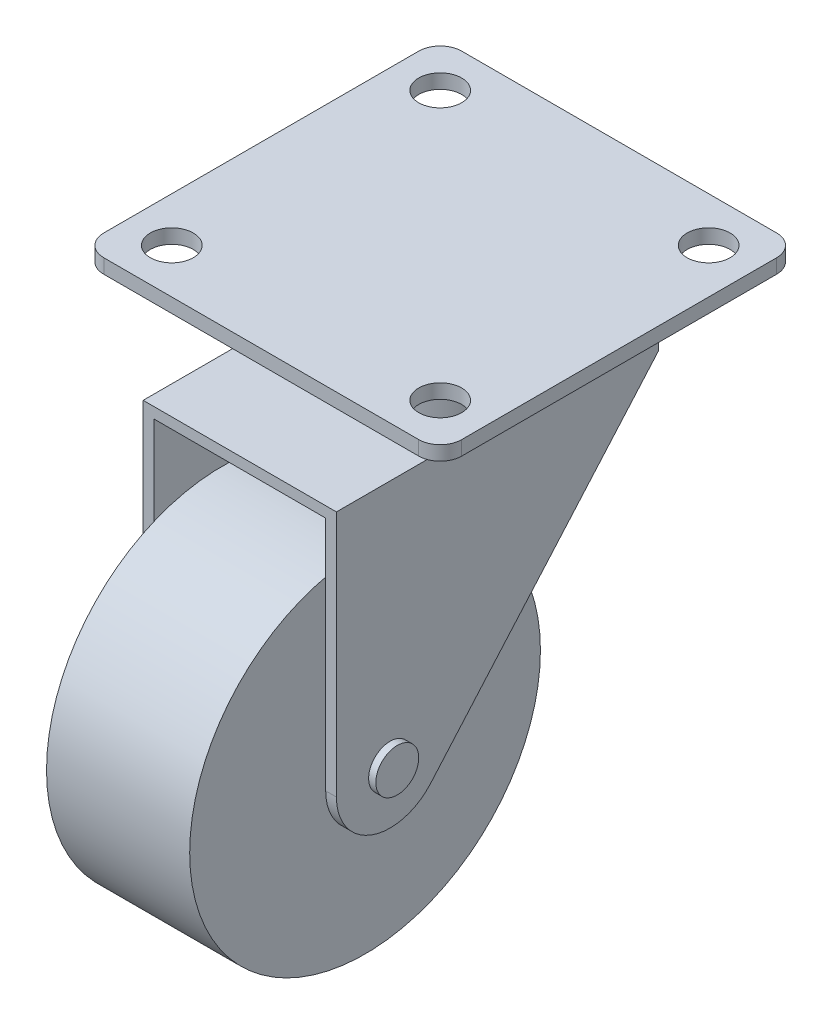
ISO-10303-21;
HEADER;
FILE_DESCRIPTION(('STEP AP214'),'2;1');
FILE_NAME('part.step','',(''),(''),'','','');
FILE_SCHEMA(('AUTOMOTIVE_DESIGN { 1 0 10303 214 1 1 1 1 }'));
ENDSEC;
DATA;
#1=APPLICATION_CONTEXT('core data for automotive mechanical design processes');
#2=APPLICATION_PROTOCOL_DEFINITION('international standard','automotive_design',2000,#1);
#3=PRODUCT_CONTEXT('',#1,'mechanical');
#4=PRODUCT('Part','Part','',(#3));
#5=PRODUCT_RELATED_PRODUCT_CATEGORY('part','',(#4));
#6=PRODUCT_DEFINITION_FORMATION('','',#4);
#7=PRODUCT_DEFINITION_CONTEXT('part definition',#1,'design');
#8=PRODUCT_DEFINITION('design','',#6,#7);
#9=PRODUCT_DEFINITION_SHAPE('','',#8);
#10=(LENGTH_UNIT() NAMED_UNIT(*) SI_UNIT(.MILLI.,.METRE.));
#11=(NAMED_UNIT(*) PLANE_ANGLE_UNIT() SI_UNIT($,.RADIAN.));
#12=(NAMED_UNIT(*) SI_UNIT($,.STERADIAN.) SOLID_ANGLE_UNIT());
#13=UNCERTAINTY_MEASURE_WITH_UNIT(LENGTH_MEASURE(1.E-05),#10,'distance_accuracy_value','');
#14=(GEOMETRIC_REPRESENTATION_CONTEXT(3) GLOBAL_UNCERTAINTY_ASSIGNED_CONTEXT((#13)) GLOBAL_UNIT_ASSIGNED_CONTEXT((#10,
#11,#12)) REPRESENTATION_CONTEXT('',''));
#15=CARTESIAN_POINT('',(0.,0.,0.));
#16=DIRECTION('',(0.,0.,1.));
#17=DIRECTION('',(1.,0.,0.));
#18=AXIS2_PLACEMENT_3D('',#15,#16,#17);
#19=CARTESIAN_POINT('',(10.,-46.,20.5));
#20=DIRECTION('',(-1.,0.,0.));
#21=DIRECTION('',(0.,0.,1.));
#22=AXIS2_PLACEMENT_3D('',#19,#20,#21);
#23=CYLINDRICAL_SURFACE('',#22,24.5);
#24=CARTESIAN_POINT('',(10.,-46.,20.5));
#25=DIRECTION('',(1.,0.,0.));
#26=DIRECTION('',(0.,0.,-1.));
#27=AXIS2_PLACEMENT_3D('',#24,#25,#26);
#28=CIRCLE('',#27,24.5);
#29=CARTESIAN_POINT('',(10.,-46.,-4.00000000000001));
#30=VERTEX_POINT('',#29);
#31=EDGE_CURVE('E12',#30,#30,#28,.T.);
#32=ORIENTED_EDGE('',*,*,#31,.F.);
#33=EDGE_LOOP('',(#32));
#34=FACE_BOUND('',#33,.T.);
#35=CARTESIAN_POINT('',(-10.,-46.,20.5));
#36=DIRECTION('',(1.,0.,0.));
#37=DIRECTION('',(0.,0.,-1.));
#38=AXIS2_PLACEMENT_3D('',#35,#36,#37);
#39=CIRCLE('',#38,24.5);
#40=CARTESIAN_POINT('',(-10.,-46.,-4.00000000000001));
#41=VERTEX_POINT('',#40);
#42=EDGE_CURVE('E53',#41,#41,#39,.T.);
#43=ORIENTED_EDGE('',*,*,#42,.T.);
#44=EDGE_LOOP('',(#43));
#45=FACE_BOUND('',#44,.T.);
#46=ADVANCED_FACE('F50',(#34,#45),#23,.T.);
#47=CARTESIAN_POINT('',(10.,-46.,20.5));
#48=DIRECTION('',(1.,0.,0.));
#49=DIRECTION('',(0.,0.,-1.));
#50=AXIS2_PLACEMENT_3D('',#47,#48,#49);
#51=PLANE('',#50);
#52=ORIENTED_EDGE('',*,*,#31,.T.);
#53=EDGE_LOOP('',(#52));
#54=FACE_BOUND('',#53,.T.);
#55=ADVANCED_FACE('F67',(#54),#51,.T.);
#56=CARTESIAN_POINT('',(-10.,-46.,20.5));
#57=DIRECTION('',(1.,0.,0.));
#58=DIRECTION('',(0.,0.,-1.));
#59=AXIS2_PLACEMENT_3D('',#56,#57,#58);
#60=PLANE('',#59);
#61=ORIENTED_EDGE('',*,*,#42,.F.);
#62=EDGE_LOOP('',(#61));
#63=FACE_BOUND('',#62,.T.);
#64=ADVANCED_FACE('F65',(#63),#60,.F.);
#65=CLOSED_SHELL('',(#46,#55,#64));
#66=MANIFOLD_SOLID_BREP('B2',#65);
#67=CARTESIAN_POINT('',(-22.,-2.,-22.));
#68=DIRECTION('',(0.,1.,0.));
#69=DIRECTION('',(0.,0.,1.));
#70=AXIS2_PLACEMENT_3D('',#67,#68,#69);
#71=CYLINDRICAL_SURFACE('',#70,3.);
#72=CARTESIAN_POINT('',(-22.,0.,-22.));
#73=DIRECTION('',(0.,1.,0.));
#74=DIRECTION('',(0.,0.,-1.));
#75=AXIS2_PLACEMENT_3D('',#72,#73,#74);
#76=CIRCLE('',#75,3.);
#77=CARTESIAN_POINT('',(-22.,0.,-25.));
#78=VERTEX_POINT('',#77);
#79=CARTESIAN_POINT('',(-25.,0.,-22.));
#80=VERTEX_POINT('',#79);
#81=EDGE_CURVE('E202',#78,#80,#76,.T.);
#82=ORIENTED_EDGE('',*,*,#81,.F.);
#83=DIRECTION('',(0.,1.,0.));
#84=VECTOR('',#83,1.);
#85=CARTESIAN_POINT('',(-22.,-2.,-25.));
#86=LINE('',#85,#84);
#87=CARTESIAN_POINT('',(-22.,-2.,-25.));
#88=VERTEX_POINT('',#87);
#89=EDGE_CURVE('E48',#88,#78,#86,.T.);
#90=ORIENTED_EDGE('',*,*,#89,.F.);
#91=CARTESIAN_POINT('',(-22.,-2.,-22.));
#92=DIRECTION('',(0.,1.,0.));
#93=DIRECTION('',(0.,0.,-1.));
#94=AXIS2_PLACEMENT_3D('',#91,#92,#93);
#95=CIRCLE('',#94,3.);
#96=CARTESIAN_POINT('',(-25.,-2.,-22.));
#97=VERTEX_POINT('',#96);
#98=EDGE_CURVE('E223',#88,#97,#95,.T.);
#99=ORIENTED_EDGE('',*,*,#98,.T.);
#100=DIRECTION('',(0.,1.,0.));
#101=VECTOR('',#100,1.);
#102=CARTESIAN_POINT('',(-25.,-2.,-22.));
#103=LINE('',#102,#101);
#104=EDGE_CURVE('E96',#97,#80,#103,.T.);
#105=ORIENTED_EDGE('',*,*,#104,.T.);
#106=EDGE_LOOP('',(#82,#90,#99,#105));
#107=FACE_BOUND('',#106,.T.);
#108=ADVANCED_FACE('F93',(#107),#71,.T.);
#109=CARTESIAN_POINT('',(-22.,-2.,-25.));
#110=DIRECTION('',(0.,0.,-1.));
#111=DIRECTION('',(-1.,0.,0.));
#112=AXIS2_PLACEMENT_3D('',#109,#110,#111);
#113=PLANE('',#112);
#114=DIRECTION('',(-1.,0.,0.));
#115=VECTOR('',#114,1.);
#116=CARTESIAN_POINT('',(-22.,0.,-25.));
#117=LINE('',#116,#115);
#118=CARTESIAN_POINT('',(22.,0.,-25.));
#119=VERTEX_POINT('',#118);
#120=EDGE_CURVE('E221',#119,#78,#117,.T.);
#121=ORIENTED_EDGE('',*,*,#120,.F.);
#122=DIRECTION('',(0.,1.,0.));
#123=VECTOR('',#122,1.);
#124=CARTESIAN_POINT('',(22.,-2.,-25.));
#125=LINE('',#124,#123);
#126=CARTESIAN_POINT('',(22.,-2.,-25.));
#127=VERTEX_POINT('',#126);
#128=EDGE_CURVE('E101',#127,#119,#125,.T.);
#129=ORIENTED_EDGE('',*,*,#128,.F.);
#130=DIRECTION('',(-1.,0.,0.));
#131=VECTOR('',#130,1.);
#132=CARTESIAN_POINT('',(-22.,-2.,-25.));
#133=LINE('',#132,#131);
#134=EDGE_CURVE('E192',#127,#88,#133,.T.);
#135=ORIENTED_EDGE('',*,*,#134,.T.);
#136=ORIENTED_EDGE('',*,*,#89,.T.);
#137=EDGE_LOOP('',(#121,#129,#135,#136));
#138=FACE_BOUND('',#137,.T.);
#139=ADVANCED_FACE('F235',(#138),#113,.T.);
#140=CARTESIAN_POINT('',(22.,-2.,-22.));
#141=DIRECTION('',(0.,1.,0.));
#142=DIRECTION('',(0.,0.,1.));
#143=AXIS2_PLACEMENT_3D('',#140,#141,#142);
#144=CYLINDRICAL_SURFACE('',#143,3.);
#145=CARTESIAN_POINT('',(22.,0.,-22.));
#146=DIRECTION('',(0.,1.,0.));
#147=DIRECTION('',(0.,0.,-1.));
#148=AXIS2_PLACEMENT_3D('',#145,#146,#147);
#149=CIRCLE('',#148,3.);
#150=CARTESIAN_POINT('',(25.,0.,-22.));
#151=VERTEX_POINT('',#150);
#152=EDGE_CURVE('E179',#151,#119,#149,.T.);
#153=ORIENTED_EDGE('',*,*,#152,.F.);
#154=DIRECTION('',(0.,1.,0.));
#155=VECTOR('',#154,1.);
#156=CARTESIAN_POINT('',(25.,-2.,-22.));
#157=LINE('',#156,#155);
#158=CARTESIAN_POINT('',(25.,-2.,-22.));
#159=VERTEX_POINT('',#158);
#160=EDGE_CURVE('E173',#159,#151,#157,.T.);
#161=ORIENTED_EDGE('',*,*,#160,.F.);
#162=CARTESIAN_POINT('',(22.,-2.,-22.));
#163=DIRECTION('',(0.,1.,0.));
#164=DIRECTION('',(0.,0.,-1.));
#165=AXIS2_PLACEMENT_3D('',#162,#163,#164);
#166=CIRCLE('',#165,3.);
#167=EDGE_CURVE('E176',#159,#127,#166,.T.);
#168=ORIENTED_EDGE('',*,*,#167,.T.);
#169=ORIENTED_EDGE('',*,*,#128,.T.);
#170=EDGE_LOOP('',(#153,#161,#168,#169));
#171=FACE_BOUND('',#170,.T.);
#172=ADVANCED_FACE('F175',(#171),#144,.T.);
#173=CARTESIAN_POINT('',(25.,-2.,22.));
#174=DIRECTION('',(1.,0.,0.));
#175=DIRECTION('',(0.,0.,-1.));
#176=AXIS2_PLACEMENT_3D('',#173,#174,#175);
#177=PLANE('',#176);
#178=DIRECTION('',(0.,0.,-1.));
#179=VECTOR('',#178,1.);
#180=CARTESIAN_POINT('',(25.,0.,22.));
#181=LINE('',#180,#179);
#182=CARTESIAN_POINT('',(25.,0.,22.));
#183=VERTEX_POINT('',#182);
#184=EDGE_CURVE('E218',#183,#151,#181,.T.);
#185=ORIENTED_EDGE('',*,*,#184,.F.);
#186=DIRECTION('',(0.,1.,0.));
#187=VECTOR('',#186,1.);
#188=CARTESIAN_POINT('',(25.,-2.,22.));
#189=LINE('',#188,#187);
#190=CARTESIAN_POINT('',(25.,-2.,22.));
#191=VERTEX_POINT('',#190);
#192=EDGE_CURVE('E184',#191,#183,#189,.T.);
#193=ORIENTED_EDGE('',*,*,#192,.F.);
#194=DIRECTION('',(0.,0.,-1.));
#195=VECTOR('',#194,1.);
#196=CARTESIAN_POINT('',(25.,-2.,22.));
#197=LINE('',#196,#195);
#198=EDGE_CURVE('E190',#191,#159,#197,.T.);
#199=ORIENTED_EDGE('',*,*,#198,.T.);
#200=ORIENTED_EDGE('',*,*,#160,.T.);
#201=EDGE_LOOP('',(#185,#193,#199,#200));
#202=FACE_BOUND('',#201,.T.);
#203=ADVANCED_FACE('F194',(#202),#177,.T.);
#204=CARTESIAN_POINT('',(22.,-2.,22.));
#205=DIRECTION('',(0.,1.,0.));
#206=DIRECTION('',(0.,0.,1.));
#207=AXIS2_PLACEMENT_3D('',#204,#205,#206);
#208=CYLINDRICAL_SURFACE('',#207,3.);
#209=CARTESIAN_POINT('',(22.,0.,22.));
#210=DIRECTION('',(0.,1.,0.));
#211=DIRECTION('',(0.,0.,1.));
#212=AXIS2_PLACEMENT_3D('',#209,#210,#211);
#213=CIRCLE('',#212,3.);
#214=CARTESIAN_POINT('',(22.,0.,25.));
#215=VERTEX_POINT('',#214);
#216=EDGE_CURVE('E215',#215,#183,#213,.T.);
#217=ORIENTED_EDGE('',*,*,#216,.F.);
#218=DIRECTION('',(0.,1.,0.));
#219=VECTOR('',#218,1.);
#220=CARTESIAN_POINT('',(22.,-2.,25.));
#221=LINE('',#220,#219);
#222=CARTESIAN_POINT('',(22.,-2.,25.));
#223=VERTEX_POINT('',#222);
#224=EDGE_CURVE('E227',#223,#215,#221,.T.);
#225=ORIENTED_EDGE('',*,*,#224,.F.);
#226=CARTESIAN_POINT('',(22.,-2.,22.));
#227=DIRECTION('',(0.,1.,0.));
#228=DIRECTION('',(0.,0.,1.));
#229=AXIS2_PLACEMENT_3D('',#226,#227,#228);
#230=CIRCLE('',#229,3.);
#231=EDGE_CURVE('E195',#223,#191,#230,.T.);
#232=ORIENTED_EDGE('',*,*,#231,.T.);
#233=ORIENTED_EDGE('',*,*,#192,.T.);
#234=EDGE_LOOP('',(#217,#225,#232,#233));
#235=FACE_BOUND('',#234,.T.);
#236=ADVANCED_FACE('F248',(#235),#208,.T.);
#237=CARTESIAN_POINT('',(-22.,-2.,25.));
#238=DIRECTION('',(0.,0.,1.));
#239=DIRECTION('',(1.,0.,0.));
#240=AXIS2_PLACEMENT_3D('',#237,#238,#239);
#241=PLANE('',#240);
#242=DIRECTION('',(1.,0.,0.));
#243=VECTOR('',#242,1.);
#244=CARTESIAN_POINT('',(-22.,0.,25.));
#245=LINE('',#244,#243);
#246=CARTESIAN_POINT('',(-22.,0.,25.));
#247=VERTEX_POINT('',#246);
#248=EDGE_CURVE('E212',#247,#215,#245,.T.);
#249=ORIENTED_EDGE('',*,*,#248,.F.);
#250=DIRECTION('',(0.,1.,0.));
#251=VECTOR('',#250,1.);
#252=CARTESIAN_POINT('',(-22.,-2.,25.));
#253=LINE('',#252,#251);
#254=CARTESIAN_POINT('',(-22.,-2.,25.));
#255=VERTEX_POINT('',#254);
#256=EDGE_CURVE('E229',#255,#247,#253,.T.);
#257=ORIENTED_EDGE('',*,*,#256,.F.);
#258=DIRECTION('',(1.,0.,0.));
#259=VECTOR('',#258,1.);
#260=CARTESIAN_POINT('',(-22.,-2.,25.));
#261=LINE('',#260,#259);
#262=EDGE_CURVE('E197',#255,#223,#261,.T.);
#263=ORIENTED_EDGE('',*,*,#262,.T.);
#264=ORIENTED_EDGE('',*,*,#224,.T.);
#265=EDGE_LOOP('',(#249,#257,#263,#264));
#266=FACE_BOUND('',#265,.T.);
#267=ADVANCED_FACE('F251',(#266),#241,.T.);
#268=CARTESIAN_POINT('',(-22.,-2.,22.));
#269=DIRECTION('',(0.,1.,0.));
#270=DIRECTION('',(0.,0.,1.));
#271=AXIS2_PLACEMENT_3D('',#268,#269,#270);
#272=CYLINDRICAL_SURFACE('',#271,3.);
#273=CARTESIAN_POINT('',(-22.,0.,22.));
#274=DIRECTION('',(0.,1.,0.));
#275=DIRECTION('',(0.,0.,-1.));
#276=AXIS2_PLACEMENT_3D('',#273,#274,#275);
#277=CIRCLE('',#276,3.);
#278=CARTESIAN_POINT('',(-25.,0.,22.));
#279=VERTEX_POINT('',#278);
#280=EDGE_CURVE('E209',#279,#247,#277,.T.);
#281=ORIENTED_EDGE('',*,*,#280,.F.);
#282=DIRECTION('',(0.,1.,0.));
#283=VECTOR('',#282,1.);
#284=CARTESIAN_POINT('',(-25.,-2.,22.));
#285=LINE('',#284,#283);
#286=CARTESIAN_POINT('',(-25.,-2.,22.));
#287=VERTEX_POINT('',#286);
#288=EDGE_CURVE('E230',#287,#279,#285,.T.);
#289=ORIENTED_EDGE('',*,*,#288,.F.);
#290=CARTESIAN_POINT('',(-22.,-2.,22.));
#291=DIRECTION('',(0.,1.,0.));
#292=DIRECTION('',(0.,0.,-1.));
#293=AXIS2_PLACEMENT_3D('',#290,#291,#292);
#294=CIRCLE('',#293,3.);
#295=EDGE_CURVE('E490',#287,#255,#294,.T.);
#296=ORIENTED_EDGE('',*,*,#295,.T.);
#297=ORIENTED_EDGE('',*,*,#256,.T.);
#298=EDGE_LOOP('',(#281,#289,#296,#297));
#299=FACE_BOUND('',#298,.T.);
#300=ADVANCED_FACE('F255',(#299),#272,.T.);
#301=CARTESIAN_POINT('',(-25.,-2.,22.));
#302=DIRECTION('',(-1.,0.,0.));
#303=DIRECTION('',(0.,0.,1.));
#304=AXIS2_PLACEMENT_3D('',#301,#302,#303);
#305=PLANE('',#304);
#306=DIRECTION('',(0.,0.,1.));
#307=VECTOR('',#306,1.);
#308=CARTESIAN_POINT('',(-25.,0.,22.));
#309=LINE('',#308,#307);
#310=EDGE_CURVE('E205',#80,#279,#309,.T.);
#311=ORIENTED_EDGE('',*,*,#310,.F.);
#312=ORIENTED_EDGE('',*,*,#104,.F.);
#313=DIRECTION('',(0.,0.,1.));
#314=VECTOR('',#313,1.);
#315=CARTESIAN_POINT('',(-25.,-2.,22.));
#316=LINE('',#315,#314);
#317=EDGE_CURVE('E488',#97,#287,#316,.T.);
#318=ORIENTED_EDGE('',*,*,#317,.T.);
#319=ORIENTED_EDGE('',*,*,#288,.T.);
#320=EDGE_LOOP('',(#311,#312,#318,#319));
#321=FACE_BOUND('',#320,.T.);
#322=ADVANCED_FACE('F232',(#321),#305,.T.);
#323=CARTESIAN_POINT('',(-22.,-2.,-22.));
#324=DIRECTION('',(0.,-1.,0.));
#325=DIRECTION('',(0.,0.,-1.));
#326=AXIS2_PLACEMENT_3D('',#323,#324,#325);
#327=PLANE('',#326);
#328=CARTESIAN_POINT('',(0.,-2.,0.));
#329=DIRECTION('',(0.,-1.,0.));
#330=DIRECTION('',(0.,0.,-1.));
#331=AXIS2_PLACEMENT_3D('',#328,#329,#330);
#332=CIRCLE('',#331,13.5);
#333=CARTESIAN_POINT('',(0.,-2.,-13.5));
#334=VERTEX_POINT('',#333);
#335=EDGE_CURVE('E460',#334,#334,#332,.T.);
#336=ORIENTED_EDGE('',*,*,#335,.F.);
#337=EDGE_LOOP('',(#336));
#338=FACE_BOUND('',#337,.T.);
#339=CARTESIAN_POINT('',(-18.75,-2.,-18.75));
#340=DIRECTION('',(0.,1.,0.));
#341=DIRECTION('',(0.,0.,1.));
#342=AXIS2_PLACEMENT_3D('',#339,#340,#341);
#343=CIRCLE('',#342,3.);
#344=CARTESIAN_POINT('',(-18.75,-2.,-15.75));
#345=VERTEX_POINT('',#344);
#346=EDGE_CURVE('E465',#345,#345,#343,.T.);
#347=ORIENTED_EDGE('',*,*,#346,.T.);
#348=EDGE_LOOP('',(#347));
#349=FACE_BOUND('',#348,.T.);
#350=CARTESIAN_POINT('',(-18.75,-2.,18.75));
#351=DIRECTION('',(0.,1.,0.));
#352=DIRECTION('',(0.,0.,1.));
#353=AXIS2_PLACEMENT_3D('',#350,#351,#352);
#354=CIRCLE('',#353,3.);
#355=CARTESIAN_POINT('',(-18.75,-2.,21.75));
#356=VERTEX_POINT('',#355);
#357=EDGE_CURVE('E471',#356,#356,#354,.T.);
#358=ORIENTED_EDGE('',*,*,#357,.T.);
#359=EDGE_LOOP('',(#358));
#360=FACE_BOUND('',#359,.T.);
#361=CARTESIAN_POINT('',(18.75,-2.,-18.75));
#362=DIRECTION('',(0.,1.,0.));
#363=DIRECTION('',(0.,0.,1.));
#364=AXIS2_PLACEMENT_3D('',#361,#362,#363);
#365=CIRCLE('',#364,3.);
#366=CARTESIAN_POINT('',(18.75,-2.,-15.75));
#367=VERTEX_POINT('',#366);
#368=EDGE_CURVE('E477',#367,#367,#365,.T.);
#369=ORIENTED_EDGE('',*,*,#368,.T.);
#370=EDGE_LOOP('',(#369));
#371=FACE_BOUND('',#370,.T.);
#372=CARTESIAN_POINT('',(18.75,-2.,18.75));
#373=DIRECTION('',(0.,1.,0.));
#374=DIRECTION('',(0.,0.,1.));
#375=AXIS2_PLACEMENT_3D('',#372,#373,#374);
#376=CIRCLE('',#375,3.);
#377=CARTESIAN_POINT('',(18.75,-2.,21.75));
#378=VERTEX_POINT('',#377);
#379=EDGE_CURVE('E206',#378,#378,#376,.T.);
#380=ORIENTED_EDGE('',*,*,#379,.T.);
#381=EDGE_LOOP('',(#380));
#382=FACE_BOUND('',#381,.T.);
#383=ORIENTED_EDGE('',*,*,#98,.F.);
#384=ORIENTED_EDGE('',*,*,#134,.F.);
#385=ORIENTED_EDGE('',*,*,#167,.F.);
#386=ORIENTED_EDGE('',*,*,#198,.F.);
#387=ORIENTED_EDGE('',*,*,#231,.F.);
#388=ORIENTED_EDGE('',*,*,#262,.F.);
#389=ORIENTED_EDGE('',*,*,#295,.F.);
#390=ORIENTED_EDGE('',*,*,#317,.F.);
#391=EDGE_LOOP('',(#383,#384,#385,#386,#387,#388,#389,#390));
#392=FACE_BOUND('',#391,.T.);
#393=ADVANCED_FACE('F188',(#338,#349,#360,#371,#382,#392),#327,.T.);
#394=CARTESIAN_POINT('',(-22.,0.,-22.));
#395=DIRECTION('',(0.,-1.,0.));
#396=DIRECTION('',(0.,0.,-1.));
#397=AXIS2_PLACEMENT_3D('',#394,#395,#396);
#398=PLANE('',#397);
#399=CARTESIAN_POINT('',(-18.75,0.,-18.75));
#400=DIRECTION('',(0.,1.,0.));
#401=DIRECTION('',(0.,0.,1.));
#402=AXIS2_PLACEMENT_3D('',#399,#400,#401);
#403=CIRCLE('',#402,3.);
#404=CARTESIAN_POINT('',(-18.75,0.,-15.75));
#405=VERTEX_POINT('',#404);
#406=EDGE_CURVE('E464',#405,#405,#403,.T.);
#407=ORIENTED_EDGE('',*,*,#406,.F.);
#408=EDGE_LOOP('',(#407));
#409=FACE_BOUND('',#408,.T.);
#410=CARTESIAN_POINT('',(-18.75,0.,18.75));
#411=DIRECTION('',(0.,1.,0.));
#412=DIRECTION('',(0.,0.,1.));
#413=AXIS2_PLACEMENT_3D('',#410,#411,#412);
#414=CIRCLE('',#413,3.);
#415=CARTESIAN_POINT('',(-18.75,0.,21.75));
#416=VERTEX_POINT('',#415);
#417=EDGE_CURVE('E468',#416,#416,#414,.T.);
#418=ORIENTED_EDGE('',*,*,#417,.F.);
#419=EDGE_LOOP('',(#418));
#420=FACE_BOUND('',#419,.T.);
#421=CARTESIAN_POINT('',(18.75,0.,-18.75));
#422=DIRECTION('',(0.,1.,0.));
#423=DIRECTION('',(0.,0.,1.));
#424=AXIS2_PLACEMENT_3D('',#421,#422,#423);
#425=CIRCLE('',#424,3.);
#426=CARTESIAN_POINT('',(18.75,0.,-15.75));
#427=VERTEX_POINT('',#426);
#428=EDGE_CURVE('E474',#427,#427,#425,.T.);
#429=ORIENTED_EDGE('',*,*,#428,.F.);
#430=EDGE_LOOP('',(#429));
#431=FACE_BOUND('',#430,.T.);
#432=CARTESIAN_POINT('',(18.75,0.,18.75));
#433=DIRECTION('',(0.,1.,0.));
#434=DIRECTION('',(0.,0.,1.));
#435=AXIS2_PLACEMENT_3D('',#432,#433,#434);
#436=CIRCLE('',#435,3.);
#437=CARTESIAN_POINT('',(18.75,0.,21.75));
#438=VERTEX_POINT('',#437);
#439=EDGE_CURVE('E480',#438,#438,#436,.T.);
#440=ORIENTED_EDGE('',*,*,#439,.F.);
#441=EDGE_LOOP('',(#440));
#442=FACE_BOUND('',#441,.T.);
#443=ORIENTED_EDGE('',*,*,#81,.T.);
#444=ORIENTED_EDGE('',*,*,#310,.T.);
#445=ORIENTED_EDGE('',*,*,#280,.T.);
#446=ORIENTED_EDGE('',*,*,#248,.T.);
#447=ORIENTED_EDGE('',*,*,#216,.T.);
#448=ORIENTED_EDGE('',*,*,#184,.T.);
#449=ORIENTED_EDGE('',*,*,#152,.T.);
#450=ORIENTED_EDGE('',*,*,#120,.T.);
#451=EDGE_LOOP('',(#443,#444,#445,#446,#447,#448,#449,#450));
#452=FACE_BOUND('',#451,.T.);
#453=ADVANCED_FACE('F234',(#409,#420,#431,#442,#452),#398,.F.);
#454=CARTESIAN_POINT('',(18.75,-2.,18.75));
#455=DIRECTION('',(0.,1.,0.));
#456=DIRECTION('',(0.,0.,1.));
#457=AXIS2_PLACEMENT_3D('',#454,#455,#456);
#458=CYLINDRICAL_SURFACE('',#457,3.);
#459=ORIENTED_EDGE('',*,*,#379,.F.);
#460=EDGE_LOOP('',(#459));
#461=FACE_BOUND('',#460,.T.);
#462=ORIENTED_EDGE('',*,*,#439,.T.);
#463=EDGE_LOOP('',(#462));
#464=FACE_BOUND('',#463,.T.);
#465=ADVANCED_FACE('F269',(#461,#464),#458,.F.);
#466=CARTESIAN_POINT('',(18.75,-2.,-18.75));
#467=DIRECTION('',(0.,1.,0.));
#468=DIRECTION('',(0.,0.,1.));
#469=AXIS2_PLACEMENT_3D('',#466,#467,#468);
#470=CYLINDRICAL_SURFACE('',#469,3.);
#471=ORIENTED_EDGE('',*,*,#368,.F.);
#472=EDGE_LOOP('',(#471));
#473=FACE_BOUND('',#472,.T.);
#474=ORIENTED_EDGE('',*,*,#428,.T.);
#475=EDGE_LOOP('',(#474));
#476=FACE_BOUND('',#475,.T.);
#477=ADVANCED_FACE('F276',(#473,#476),#470,.F.);
#478=CARTESIAN_POINT('',(-18.75,-2.,18.75));
#479=DIRECTION('',(0.,1.,0.));
#480=DIRECTION('',(0.,0.,1.));
#481=AXIS2_PLACEMENT_3D('',#478,#479,#480);
#482=CYLINDRICAL_SURFACE('',#481,3.);
#483=ORIENTED_EDGE('',*,*,#357,.F.);
#484=EDGE_LOOP('',(#483));
#485=FACE_BOUND('',#484,.T.);
#486=ORIENTED_EDGE('',*,*,#417,.T.);
#487=EDGE_LOOP('',(#486));
#488=FACE_BOUND('',#487,.T.);
#489=ADVANCED_FACE('F280',(#485,#488),#482,.F.);
#490=CARTESIAN_POINT('',(-18.75,-2.,-18.75));
#491=DIRECTION('',(0.,1.,0.));
#492=DIRECTION('',(0.,0.,1.));
#493=AXIS2_PLACEMENT_3D('',#490,#491,#492);
#494=CYLINDRICAL_SURFACE('',#493,3.);
#495=ORIENTED_EDGE('',*,*,#346,.F.);
#496=EDGE_LOOP('',(#495));
#497=FACE_BOUND('',#496,.T.);
#498=ORIENTED_EDGE('',*,*,#406,.T.);
#499=EDGE_LOOP('',(#498));
#500=FACE_BOUND('',#499,.T.);
#501=ADVANCED_FACE('F284',(#497,#500),#494,.F.);
#502=CARTESIAN_POINT('',(0.,36.1837661840736,0.));
#503=DIRECTION('',(0.,-1.,0.));
#504=DIRECTION('',(1.,0.,0.));
#505=AXIS2_PLACEMENT_3D('',#502,#503,#504);
#506=CYLINDRICAL_SURFACE('',#505,13.5);
#507=ORIENTED_EDGE('',*,*,#335,.T.);
#508=EDGE_LOOP('',(#507));
#509=FACE_BOUND('',#508,.T.);
#510=CARTESIAN_POINT('',(0.,-11.5,0.));
#511=DIRECTION('',(0.,1.,0.));
#512=DIRECTION('',(-1.,0.,0.));
#513=AXIS2_PLACEMENT_3D('',#510,#511,#512);
#514=CIRCLE('',#513,13.5);
#515=CARTESIAN_POINT('',(-13.5,-11.5,0.));
#516=VERTEX_POINT('',#515);
#517=CARTESIAN_POINT('',(13.5,-11.5,0.));
#518=VERTEX_POINT('',#517);
#519=EDGE_CURVE('E457',#516,#518,#514,.T.);
#520=ORIENTED_EDGE('',*,*,#519,.T.);
#521=EDGE_CURVE('E461',#518,#516,#514,.T.);
#522=ORIENTED_EDGE('',*,*,#521,.T.);
#523=EDGE_LOOP('',(#520,#522));
#524=FACE_BOUND('',#523,.T.);
#525=ADVANCED_FACE('F288',(#509,#524),#506,.T.);
#526=CARTESIAN_POINT('',(13.5,-11.5,28.));
#527=DIRECTION('',(0.,-1.,0.));
#528=DIRECTION('',(1.,0.,0.));
#529=AXIS2_PLACEMENT_3D('',#526,#527,#528);
#530=PLANE('',#529);
#531=ORIENTED_EDGE('',*,*,#519,.F.);
#532=DIRECTION('',(0.,0.,-1.));
#533=VECTOR('',#532,1.);
#534=CARTESIAN_POINT('',(-13.5,-11.5,28.));
#535=LINE('',#534,#533);
#536=CARTESIAN_POINT('',(-13.5,-11.5,28.));
#537=VERTEX_POINT('',#536);
#538=EDGE_CURVE('E109',#537,#516,#535,.T.);
#539=ORIENTED_EDGE('',*,*,#538,.F.);
#540=DIRECTION('',(-1.,0.,0.));
#541=VECTOR('',#540,1.);
#542=CARTESIAN_POINT('',(13.5,-11.5,28.));
#543=LINE('',#542,#541);
#544=CARTESIAN_POINT('',(13.5,-11.5,28.));
#545=VERTEX_POINT('',#544);
#546=EDGE_CURVE('E432',#545,#537,#543,.T.);
#547=ORIENTED_EDGE('',*,*,#546,.F.);
#548=DIRECTION('',(0.,0.,-1.));
#549=VECTOR('',#548,1.);
#550=CARTESIAN_POINT('',(13.5,-11.5,28.));
#551=LINE('',#550,#549);
#552=EDGE_CURVE('E438',#545,#518,#551,.T.);
#553=ORIENTED_EDGE('',*,*,#552,.T.);
#554=EDGE_LOOP('',(#531,#539,#547,#553));
#555=FACE_BOUND('',#554,.T.);
#556=ADVANCED_FACE('F292',(#555),#530,.F.);
#557=CARTESIAN_POINT('',(-13.5,-53.5,28.));
#558=DIRECTION('',(1.,0.,0.));
#559=DIRECTION('',(0.,1.,0.));
#560=AXIS2_PLACEMENT_3D('',#557,#558,#559);
#561=PLANE('',#560);
#562=CARTESIAN_POINT('',(-13.5,-46.,20.5));
#563=DIRECTION('',(1.,0.,0.));
#564=DIRECTION('',(0.,1.,0.));
#565=AXIS2_PLACEMENT_3D('',#562,#563,#564);
#566=CIRCLE('',#565,3.);
#567=CARTESIAN_POINT('',(-13.5,-43.,20.5));
#568=VERTEX_POINT('',#567);
#569=EDGE_CURVE('E368',#568,#568,#566,.T.);
#570=ORIENTED_EDGE('',*,*,#569,.T.);
#571=EDGE_LOOP('',(#570));
#572=FACE_BOUND('',#571,.T.);
#573=DIRECTION('',(0.,0.75286600732258,-0.658173818241167));
#574=VECTOR('',#573,1.);
#575=CARTESIAN_POINT('',(-13.5,-58.9037330341487,21.818825967693));
#576=LINE('',#575,#574);
#577=CARTESIAN_POINT('',(-13.5,-50.9363036368087,14.8535049450806));
#578=VERTEX_POINT('',#577);
#579=CARTESIAN_POINT('',(-13.5,-14.5,-17.));
#580=VERTEX_POINT('',#579);
#581=EDGE_CURVE('E384',#578,#580,#576,.T.);
#582=ORIENTED_EDGE('',*,*,#581,.F.);
#583=CARTESIAN_POINT('',(-13.5,-46.,20.5));
#584=DIRECTION('',(1.,0.,0.));
#585=DIRECTION('',(0.,1.,0.));
#586=AXIS2_PLACEMENT_3D('',#583,#584,#585);
#587=CIRCLE('',#586,7.5);
#588=CARTESIAN_POINT('',(-13.5,-46.,28.));
#589=VERTEX_POINT('',#588);
#590=EDGE_CURVE('E396',#589,#578,#587,.T.);
#591=ORIENTED_EDGE('',*,*,#590,.F.);
#592=DIRECTION('',(0.,-1.,0.));
#593=VECTOR('',#592,1.);
#594=CARTESIAN_POINT('',(-13.5,-53.5,28.));
#595=LINE('',#594,#593);
#596=EDGE_CURVE('E417',#537,#589,#595,.T.);
#597=ORIENTED_EDGE('',*,*,#596,.F.);
#598=ORIENTED_EDGE('',*,*,#538,.T.);
#599=CARTESIAN_POINT('',(-13.5,-11.5,-17.));
#600=VERTEX_POINT('',#599);
#601=EDGE_CURVE('E435',#516,#600,#535,.T.);
#602=ORIENTED_EDGE('',*,*,#601,.T.);
#603=DIRECTION('',(0.,-1.,0.));
#604=VECTOR('',#603,1.);
#605=CARTESIAN_POINT('',(-13.5,-53.5,-17.));
#606=LINE('',#605,#604);
#607=EDGE_CURVE('E399',#600,#580,#606,.T.);
#608=ORIENTED_EDGE('',*,*,#607,.T.);
#609=EDGE_LOOP('',(#582,#591,#597,#598,#602,#608));
#610=FACE_BOUND('',#609,.T.);
#611=ADVANCED_FACE('F294',(#572,#610),#561,.F.);
#612=CARTESIAN_POINT('',(-12.,-53.5,28.));
#613=DIRECTION('',(-1.,0.,0.));
#614=DIRECTION('',(0.,0.,1.));
#615=AXIS2_PLACEMENT_3D('',#612,#613,#614);
#616=PLANE('',#615);
#617=CARTESIAN_POINT('',(-12.,-46.,20.5));
#618=DIRECTION('',(-1.,0.,0.));
#619=DIRECTION('',(0.,0.,1.));
#620=AXIS2_PLACEMENT_3D('',#617,#618,#619);
#621=CIRCLE('',#620,3.);
#622=CARTESIAN_POINT('',(-12.,-46.,23.5));
#623=VERTEX_POINT('',#622);
#624=EDGE_CURVE('E365',#623,#623,#621,.T.);
#625=ORIENTED_EDGE('',*,*,#624,.T.);
#626=EDGE_LOOP('',(#625));
#627=FACE_BOUND('',#626,.T.);
#628=DIRECTION('',(0.,-0.75286600732258,0.658173818241167));
#629=VECTOR('',#628,1.);
#630=CARTESIAN_POINT('',(-12.,-58.9037330341487,21.818825967693));
#631=LINE('',#630,#629);
#632=CARTESIAN_POINT('',(-12.,-14.5,-17.));
#633=VERTEX_POINT('',#632);
#634=CARTESIAN_POINT('',(-12.,-50.9363036368087,14.8535049450806));
#635=VERTEX_POINT('',#634);
#636=EDGE_CURVE('E381',#633,#635,#631,.T.);
#637=ORIENTED_EDGE('',*,*,#636,.F.);
#638=DIRECTION('',(0.,1.,0.));
#639=VECTOR('',#638,1.);
#640=CARTESIAN_POINT('',(-12.,-53.5,-17.));
#641=LINE('',#640,#639);
#642=CARTESIAN_POINT('',(-12.,-13.,-17.));
#643=VERTEX_POINT('',#642);
#644=EDGE_CURVE('E402',#633,#643,#641,.T.);
#645=ORIENTED_EDGE('',*,*,#644,.T.);
#646=DIRECTION('',(0.,0.,-1.));
#647=VECTOR('',#646,1.);
#648=CARTESIAN_POINT('',(-12.,-13.,28.));
#649=LINE('',#648,#647);
#650=CARTESIAN_POINT('',(-12.,-13.,28.));
#651=VERTEX_POINT('',#650);
#652=EDGE_CURVE('E444',#651,#643,#649,.T.);
#653=ORIENTED_EDGE('',*,*,#652,.F.);
#654=DIRECTION('',(0.,1.,0.));
#655=VECTOR('',#654,1.);
#656=CARTESIAN_POINT('',(-12.,-53.5,28.));
#657=LINE('',#656,#655);
#658=CARTESIAN_POINT('',(-12.,-46.,28.));
#659=VERTEX_POINT('',#658);
#660=EDGE_CURVE('E420',#659,#651,#657,.T.);
#661=ORIENTED_EDGE('',*,*,#660,.F.);
#662=CARTESIAN_POINT('',(-12.,-46.,20.5));
#663=DIRECTION('',(-1.,0.,0.));
#664=DIRECTION('',(0.,0.,1.));
#665=AXIS2_PLACEMENT_3D('',#662,#663,#664);
#666=CIRCLE('',#665,7.5);
#667=EDGE_CURVE('E393',#635,#659,#666,.T.);
#668=ORIENTED_EDGE('',*,*,#667,.F.);
#669=EDGE_LOOP('',(#637,#645,#653,#661,#668));
#670=FACE_BOUND('',#669,.T.);
#671=ADVANCED_FACE('F297',(#627,#670),#616,.F.);
#672=CARTESIAN_POINT('',(12.,-53.5,28.));
#673=DIRECTION('',(1.,0.,0.));
#674=DIRECTION('',(0.,0.,-1.));
#675=AXIS2_PLACEMENT_3D('',#672,#673,#674);
#676=PLANE('',#675);
#677=CARTESIAN_POINT('',(12.,-46.,20.5));
#678=DIRECTION('',(1.,0.,0.));
#679=DIRECTION('',(0.,0.,-1.));
#680=AXIS2_PLACEMENT_3D('',#677,#678,#679);
#681=CIRCLE('',#680,3.);
#682=CARTESIAN_POINT('',(12.,-46.,17.5));
#683=VERTEX_POINT('',#682);
#684=EDGE_CURVE('E362',#683,#683,#681,.T.);
#685=ORIENTED_EDGE('',*,*,#684,.T.);
#686=EDGE_LOOP('',(#685));
#687=FACE_BOUND('',#686,.T.);
#688=DIRECTION('',(0.,0.75286600732258,-0.658173818241167));
#689=VECTOR('',#688,1.);
#690=CARTESIAN_POINT('',(12.,-58.9037330341487,21.818825967693));
#691=LINE('',#690,#689);
#692=CARTESIAN_POINT('',(12.,-50.9363036368087,14.8535049450806));
#693=VERTEX_POINT('',#692);
#694=CARTESIAN_POINT('',(12.,-14.5,-17.));
#695=VERTEX_POINT('',#694);
#696=EDGE_CURVE('E378',#693,#695,#691,.T.);
#697=ORIENTED_EDGE('',*,*,#696,.F.);
#698=CARTESIAN_POINT('',(12.,-46.,20.5));
#699=DIRECTION('',(1.,0.,0.));
#700=DIRECTION('',(0.,0.,-1.));
#701=AXIS2_PLACEMENT_3D('',#698,#699,#700);
#702=CIRCLE('',#701,7.5);
#703=CARTESIAN_POINT('',(12.,-46.,28.));
#704=VERTEX_POINT('',#703);
#705=EDGE_CURVE('E390',#704,#693,#702,.T.);
#706=ORIENTED_EDGE('',*,*,#705,.F.);
#707=DIRECTION('',(0.,-1.,0.));
#708=VECTOR('',#707,1.);
#709=CARTESIAN_POINT('',(12.,-53.5,28.));
#710=LINE('',#709,#708);
#711=CARTESIAN_POINT('',(12.,-13.,28.));
#712=VERTEX_POINT('',#711);
#713=EDGE_CURVE('E426',#712,#704,#710,.T.);
#714=ORIENTED_EDGE('',*,*,#713,.F.);
#715=DIRECTION('',(0.,0.,-1.));
#716=VECTOR('',#715,1.);
#717=CARTESIAN_POINT('',(12.,-13.,28.));
#718=LINE('',#717,#716);
#719=CARTESIAN_POINT('',(12.,-13.,-17.));
#720=VERTEX_POINT('',#719);
#721=EDGE_CURVE('E441',#712,#720,#718,.T.);
#722=ORIENTED_EDGE('',*,*,#721,.T.);
#723=DIRECTION('',(0.,-1.,0.));
#724=VECTOR('',#723,1.);
#725=CARTESIAN_POINT('',(12.,-53.5,-17.));
#726=LINE('',#725,#724);
#727=EDGE_CURVE('E408',#720,#695,#726,.T.);
#728=ORIENTED_EDGE('',*,*,#727,.T.);
#729=EDGE_LOOP('',(#697,#706,#714,#722,#728));
#730=FACE_BOUND('',#729,.T.);
#731=ADVANCED_FACE('F301',(#687,#730),#676,.F.);
#732=CARTESIAN_POINT('',(13.5,-53.5,28.));
#733=DIRECTION('',(-1.,0.,0.));
#734=DIRECTION('',(0.,-1.,0.));
#735=AXIS2_PLACEMENT_3D('',#732,#733,#734);
#736=PLANE('',#735);
#737=CARTESIAN_POINT('',(13.5,-46.,20.5));
#738=DIRECTION('',(-1.,0.,0.));
#739=DIRECTION('',(0.,-1.,0.));
#740=AXIS2_PLACEMENT_3D('',#737,#738,#739);
#741=CIRCLE('',#740,3.);
#742=CARTESIAN_POINT('',(13.5,-49.,20.5));
#743=VERTEX_POINT('',#742);
#744=EDGE_CURVE('E359',#743,#743,#741,.T.);
#745=ORIENTED_EDGE('',*,*,#744,.T.);
#746=EDGE_LOOP('',(#745));
#747=FACE_BOUND('',#746,.T.);
#748=DIRECTION('',(0.,-0.75286600732258,0.658173818241167));
#749=VECTOR('',#748,1.);
#750=CARTESIAN_POINT('',(13.5,-58.9037330341487,21.818825967693));
#751=LINE('',#750,#749);
#752=CARTESIAN_POINT('',(13.5,-14.5,-17.));
#753=VERTEX_POINT('',#752);
#754=CARTESIAN_POINT('',(13.5,-50.9363036368087,14.8535049450806));
#755=VERTEX_POINT('',#754);
#756=EDGE_CURVE('E375',#753,#755,#751,.T.);
#757=ORIENTED_EDGE('',*,*,#756,.F.);
#758=DIRECTION('',(0.,1.,0.));
#759=VECTOR('',#758,1.);
#760=CARTESIAN_POINT('',(13.5,-53.5,-17.));
#761=LINE('',#760,#759);
#762=CARTESIAN_POINT('',(13.5,-11.5,-17.));
#763=VERTEX_POINT('',#762);
#764=EDGE_CURVE('E411',#753,#763,#761,.T.);
#765=ORIENTED_EDGE('',*,*,#764,.T.);
#766=EDGE_CURVE('E437',#518,#763,#551,.T.);
#767=ORIENTED_EDGE('',*,*,#766,.F.);
#768=ORIENTED_EDGE('',*,*,#552,.F.);
#769=DIRECTION('',(0.,1.,0.));
#770=VECTOR('',#769,1.);
#771=CARTESIAN_POINT('',(13.5,-53.5,28.));
#772=LINE('',#771,#770);
#773=CARTESIAN_POINT('',(13.5,-46.,28.));
#774=VERTEX_POINT('',#773);
#775=EDGE_CURVE('E429',#774,#545,#772,.T.);
#776=ORIENTED_EDGE('',*,*,#775,.F.);
#777=CARTESIAN_POINT('',(13.5,-46.,20.5));
#778=DIRECTION('',(-1.,0.,0.));
#779=DIRECTION('',(0.,-1.,0.));
#780=AXIS2_PLACEMENT_3D('',#777,#778,#779);
#781=CIRCLE('',#780,7.5);
#782=EDGE_CURVE('E387',#755,#774,#781,.T.);
#783=ORIENTED_EDGE('',*,*,#782,.F.);
#784=EDGE_LOOP('',(#757,#765,#767,#768,#776,#783));
#785=FACE_BOUND('',#784,.T.);
#786=ADVANCED_FACE('F311',(#747,#785),#736,.F.);
#787=CARTESIAN_POINT('',(0.,0.,28.));
#788=DIRECTION('',(0.,0.,1.));
#789=DIRECTION('',(1.,0.,0.));
#790=AXIS2_PLACEMENT_3D('',#787,#788,#789);
#791=PLANE('',#790);
#792=ORIENTED_EDGE('',*,*,#596,.T.);
#793=DIRECTION('',(1.,0.,0.));
#794=VECTOR('',#793,1.);
#795=CARTESIAN_POINT('',(-25.,-46.,28.));
#796=LINE('',#795,#794);
#797=EDGE_CURVE('E454',#589,#659,#796,.T.);
#798=ORIENTED_EDGE('',*,*,#797,.T.);
#799=ORIENTED_EDGE('',*,*,#660,.T.);
#800=DIRECTION('',(1.,0.,0.));
#801=VECTOR('',#800,1.);
#802=CARTESIAN_POINT('',(12.,-13.,28.));
#803=LINE('',#802,#801);
#804=EDGE_CURVE('E423',#651,#712,#803,.T.);
#805=ORIENTED_EDGE('',*,*,#804,.T.);
#806=ORIENTED_EDGE('',*,*,#713,.T.);
#807=EDGE_CURVE('E451',#704,#774,#796,.T.);
#808=ORIENTED_EDGE('',*,*,#807,.T.);
#809=ORIENTED_EDGE('',*,*,#775,.T.);
#810=ORIENTED_EDGE('',*,*,#546,.T.);
#811=EDGE_LOOP('',(#792,#798,#799,#805,#806,#808,#809,#810));
#812=FACE_BOUND('',#811,.T.);
#813=ADVANCED_FACE('F315',(#812),#791,.T.);
#814=CARTESIAN_POINT('',(0.,0.,-17.));
#815=DIRECTION('',(0.,0.,1.));
#816=DIRECTION('',(1.,0.,0.));
#817=AXIS2_PLACEMENT_3D('',#814,#815,#816);
#818=PLANE('',#817);
#819=DIRECTION('',(1.,0.,0.));
#820=VECTOR('',#819,1.);
#821=CARTESIAN_POINT('',(0.,-14.5,-17.));
#822=LINE('',#821,#820);
#823=EDGE_CURVE('E450',#580,#633,#822,.T.);
#824=ORIENTED_EDGE('',*,*,#823,.F.);
#825=ORIENTED_EDGE('',*,*,#607,.F.);
#826=DIRECTION('',(-1.,0.,0.));
#827=VECTOR('',#826,1.);
#828=CARTESIAN_POINT('',(13.5,-11.5,-17.));
#829=LINE('',#828,#827);
#830=EDGE_CURVE('E414',#763,#600,#829,.T.);
#831=ORIENTED_EDGE('',*,*,#830,.F.);
#832=ORIENTED_EDGE('',*,*,#764,.F.);
#833=EDGE_CURVE('E447',#695,#753,#822,.T.);
#834=ORIENTED_EDGE('',*,*,#833,.F.);
#835=ORIENTED_EDGE('',*,*,#727,.F.);
#836=DIRECTION('',(1.,0.,0.));
#837=VECTOR('',#836,1.);
#838=CARTESIAN_POINT('',(12.,-13.,-17.));
#839=LINE('',#838,#837);
#840=EDGE_CURVE('E405',#643,#720,#839,.T.);
#841=ORIENTED_EDGE('',*,*,#840,.F.);
#842=ORIENTED_EDGE('',*,*,#644,.F.);
#843=EDGE_LOOP('',(#824,#825,#831,#832,#834,#835,#841,#842));
#844=FACE_BOUND('',#843,.T.);
#845=ADVANCED_FACE('F307',(#844),#818,.F.);
#846=CARTESIAN_POINT('',(12.,-13.,28.));
#847=DIRECTION('',(0.,1.,0.));
#848=DIRECTION('',(-1.,0.,0.));
#849=AXIS2_PLACEMENT_3D('',#846,#847,#848);
#850=PLANE('',#849);
#851=ORIENTED_EDGE('',*,*,#652,.T.);
#852=ORIENTED_EDGE('',*,*,#840,.T.);
#853=ORIENTED_EDGE('',*,*,#721,.F.);
#854=ORIENTED_EDGE('',*,*,#804,.F.);
#855=EDGE_LOOP('',(#851,#852,#853,#854));
#856=FACE_BOUND('',#855,.T.);
#857=ADVANCED_FACE('F303',(#856),#850,.F.);
#858=ORIENTED_EDGE('',*,*,#521,.F.);
#859=ORIENTED_EDGE('',*,*,#766,.T.);
#860=ORIENTED_EDGE('',*,*,#830,.T.);
#861=ORIENTED_EDGE('',*,*,#601,.F.);
#862=EDGE_LOOP('',(#858,#859,#860,#861));
#863=FACE_BOUND('',#862,.T.);
#864=ADVANCED_FACE('F306',(#863),#530,.F.);
#865=CARTESIAN_POINT('',(-25.,-14.5,-17.));
#866=DIRECTION('',(0.,-0.658173818241167,-0.75286600732258));
#867=DIRECTION('',(0.,0.75286600732258,-0.658173818241167));
#868=AXIS2_PLACEMENT_3D('',#865,#866,#867);
#869=PLANE('',#868);
#870=ORIENTED_EDGE('',*,*,#696,.T.);
#871=ORIENTED_EDGE('',*,*,#833,.T.);
#872=ORIENTED_EDGE('',*,*,#756,.T.);
#873=DIRECTION('',(1.,0.,0.));
#874=VECTOR('',#873,1.);
#875=CARTESIAN_POINT('',(-25.,-50.9363036368087,14.8535049450806));
#876=LINE('',#875,#874);
#877=EDGE_CURVE('E371',#693,#755,#876,.T.);
#878=ORIENTED_EDGE('',*,*,#877,.F.);
#879=EDGE_LOOP('',(#870,#871,#872,#878));
#880=FACE_BOUND('',#879,.T.);
#881=ADVANCED_FACE('F319',(#880),#869,.T.);
#882=CARTESIAN_POINT('',(-25.,-46.,20.5));
#883=DIRECTION('',(1.,0.,0.));
#884=DIRECTION('',(0.,0.,-1.));
#885=AXIS2_PLACEMENT_3D('',#882,#883,#884);
#886=CYLINDRICAL_SURFACE('',#885,7.5);
#887=ORIENTED_EDGE('',*,*,#705,.T.);
#888=ORIENTED_EDGE('',*,*,#877,.T.);
#889=ORIENTED_EDGE('',*,*,#782,.T.);
#890=ORIENTED_EDGE('',*,*,#807,.F.);
#891=EDGE_LOOP('',(#887,#888,#889,#890));
#892=FACE_BOUND('',#891,.T.);
#893=ADVANCED_FACE('F331',(#892),#886,.T.);
#894=ORIENTED_EDGE('',*,*,#590,.T.);
#895=EDGE_CURVE('E374',#578,#635,#876,.T.);
#896=ORIENTED_EDGE('',*,*,#895,.T.);
#897=ORIENTED_EDGE('',*,*,#667,.T.);
#898=ORIENTED_EDGE('',*,*,#797,.F.);
#899=EDGE_LOOP('',(#894,#896,#897,#898));
#900=FACE_BOUND('',#899,.T.);
#901=ADVANCED_FACE('F327',(#900),#886,.T.);
#902=ORIENTED_EDGE('',*,*,#581,.T.);
#903=ORIENTED_EDGE('',*,*,#823,.T.);
#904=ORIENTED_EDGE('',*,*,#636,.T.);
#905=ORIENTED_EDGE('',*,*,#895,.F.);
#906=EDGE_LOOP('',(#902,#903,#904,#905));
#907=FACE_BOUND('',#906,.T.);
#908=ADVANCED_FACE('F330',(#907),#869,.T.);
#909=CARTESIAN_POINT('',(14.5,-46.,20.5));
#910=DIRECTION('',(1.,0.,0.));
#911=DIRECTION('',(0.,1.,0.));
#912=AXIS2_PLACEMENT_3D('',#909,#910,#911);
#913=PLANE('',#912);
#914=CARTESIAN_POINT('',(14.5,-46.,20.5));
#915=DIRECTION('',(1.,0.,0.));
#916=DIRECTION('',(0.,1.,0.));
#917=AXIS2_PLACEMENT_3D('',#914,#915,#916);
#918=CIRCLE('',#917,3.);
#919=CARTESIAN_POINT('',(14.5,-43.,20.5));
#920=VERTEX_POINT('',#919);
#921=EDGE_CURVE('E355',#920,#920,#918,.T.);
#922=ORIENTED_EDGE('',*,*,#921,.T.);
#923=EDGE_LOOP('',(#922));
#924=FACE_BOUND('',#923,.T.);
#925=ADVANCED_FACE('F335',(#924),#913,.T.);
#926=CARTESIAN_POINT('',(-23.9852813742386,-46.,20.5));
#927=DIRECTION('',(1.,0.,0.));
#928=DIRECTION('',(0.,1.,0.));
#929=AXIS2_PLACEMENT_3D('',#926,#927,#928);
#930=CYLINDRICAL_SURFACE('',#929,3.);
#931=ORIENTED_EDGE('',*,*,#921,.F.);
#932=EDGE_LOOP('',(#931));
#933=FACE_BOUND('',#932,.T.);
#934=ORIENTED_EDGE('',*,*,#744,.F.);
#935=EDGE_LOOP('',(#934));
#936=FACE_BOUND('',#935,.T.);
#937=ADVANCED_FACE('F343',(#933,#936),#930,.T.);
#938=ORIENTED_EDGE('',*,*,#684,.F.);
#939=EDGE_LOOP('',(#938));
#940=FACE_BOUND('',#939,.T.);
#941=ORIENTED_EDGE('',*,*,#624,.F.);
#942=EDGE_LOOP('',(#941));
#943=FACE_BOUND('',#942,.T.);
#944=ADVANCED_FACE('F341',(#940,#943),#930,.T.);
#945=CARTESIAN_POINT('',(-14.5,-46.,20.5));
#946=DIRECTION('',(1.,0.,0.));
#947=DIRECTION('',(0.,1.,0.));
#948=AXIS2_PLACEMENT_3D('',#945,#946,#947);
#949=CIRCLE('',#948,3.);
#950=CARTESIAN_POINT('',(-14.5,-43.,20.5));
#951=VERTEX_POINT('',#950);
#952=EDGE_CURVE('E356',#951,#951,#949,.F.);
#953=ORIENTED_EDGE('',*,*,#952,.F.);
#954=EDGE_LOOP('',(#953));
#955=FACE_BOUND('',#954,.T.);
#956=ORIENTED_EDGE('',*,*,#569,.F.);
#957=EDGE_LOOP('',(#956));
#958=FACE_BOUND('',#957,.T.);
#959=ADVANCED_FACE('F337',(#955,#958),#930,.T.);
#960=CARTESIAN_POINT('',(-14.5,-53.5,28.));
#961=DIRECTION('',(1.,0.,0.));
#962=DIRECTION('',(0.,1.,0.));
#963=AXIS2_PLACEMENT_3D('',#960,#961,#962);
#964=PLANE('',#963);
#965=ORIENTED_EDGE('',*,*,#952,.T.);
#966=EDGE_LOOP('',(#965));
#967=FACE_BOUND('',#966,.T.);
#968=ADVANCED_FACE('F340',(#967),#964,.F.);
#969=CLOSED_SHELL('',(#108,#139,#172,#203,#236,#267,#300,#322,#393,#453,#465,#477,#489,#501,
#525,#556,#611,#671,#731,#786,#813,#845,#857,#864,#881,#893,#901,#908,#925,#937,#944,#959,#968));
#970=MANIFOLD_SOLID_BREP('B7',#969);
#971=ADVANCED_BREP_SHAPE_REPRESENTATION('',(#18,#66,#970),#14);
#972=SHAPE_DEFINITION_REPRESENTATION(#9,#971);
ENDSEC;
END-ISO-10303-21;
